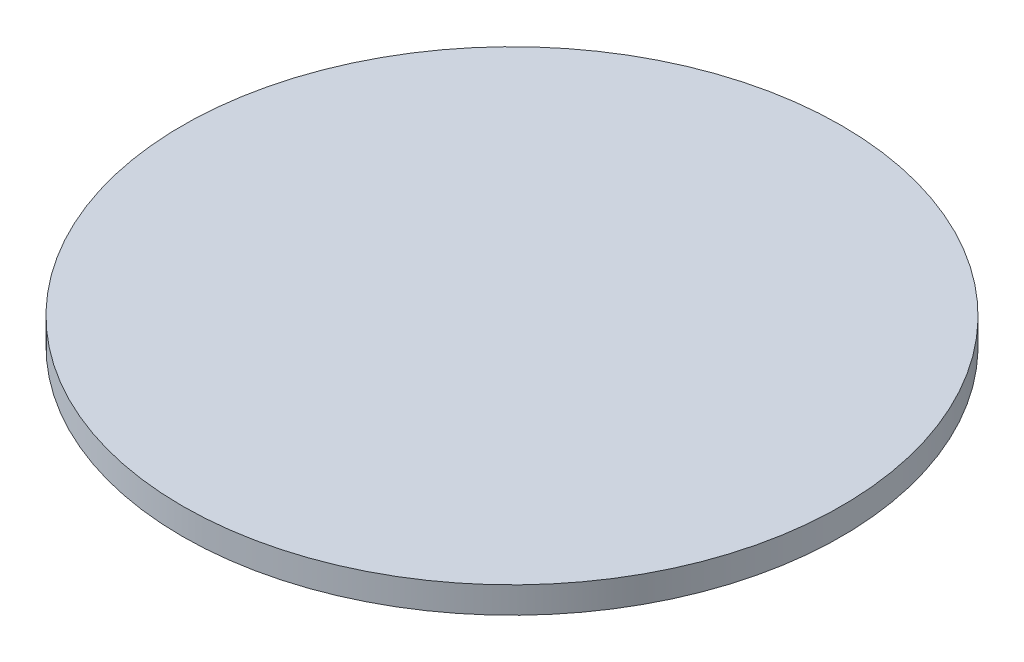
ISO-10303-21;
HEADER;
FILE_DESCRIPTION(('STEP AP214'),'2;1');
FILE_NAME('part.step','',(''),(''),'','','');
FILE_SCHEMA(('AUTOMOTIVE_DESIGN { 1 0 10303 214 1 1 1 1 }'));
ENDSEC;
DATA;
#1=APPLICATION_CONTEXT('core data for automotive mechanical design processes');
#2=APPLICATION_PROTOCOL_DEFINITION('international standard','automotive_design',2000,#1);
#3=PRODUCT_CONTEXT('',#1,'mechanical');
#4=PRODUCT('Part','Part','',(#3));
#5=PRODUCT_RELATED_PRODUCT_CATEGORY('part','',(#4));
#6=PRODUCT_DEFINITION_FORMATION('','',#4);
#7=PRODUCT_DEFINITION_CONTEXT('part definition',#1,'design');
#8=PRODUCT_DEFINITION('design','',#6,#7);
#9=PRODUCT_DEFINITION_SHAPE('','',#8);
#10=(LENGTH_UNIT() NAMED_UNIT(*) SI_UNIT(.MILLI.,.METRE.));
#11=(NAMED_UNIT(*) PLANE_ANGLE_UNIT() SI_UNIT($,.RADIAN.));
#12=(NAMED_UNIT(*) SI_UNIT($,.STERADIAN.) SOLID_ANGLE_UNIT());
#13=UNCERTAINTY_MEASURE_WITH_UNIT(LENGTH_MEASURE(1.E-05),#10,'distance_accuracy_value','');
#14=(GEOMETRIC_REPRESENTATION_CONTEXT(3) GLOBAL_UNCERTAINTY_ASSIGNED_CONTEXT((#13)) GLOBAL_UNIT_ASSIGNED_CONTEXT((#10,
#11,#12)) REPRESENTATION_CONTEXT('',''));
#15=CARTESIAN_POINT('',(0.,0.,0.));
#16=DIRECTION('',(0.,0.,1.));
#17=DIRECTION('',(1.,0.,0.));
#18=AXIS2_PLACEMENT_3D('',#15,#16,#17);
#19=CARTESIAN_POINT('',(0.,2.,0.));
#20=DIRECTION('',(0.,-1.,0.));
#21=DIRECTION('',(0.,0.,-1.));
#22=AXIS2_PLACEMENT_3D('',#19,#20,#21);
#23=CYLINDRICAL_SURFACE('',#22,25.);
#24=CARTESIAN_POINT('',(0.,2.,0.));
#25=DIRECTION('',(0.,1.,0.));
#26=DIRECTION('',(0.,0.,1.));
#27=AXIS2_PLACEMENT_3D('',#24,#25,#26);
#28=CIRCLE('',#27,25.);
#29=CARTESIAN_POINT('',(0.,2.,25.));
#30=VERTEX_POINT('',#29);
#31=EDGE_CURVE('E10',#30,#30,#28,.T.);
#32=ORIENTED_EDGE('',*,*,#31,.F.);
#33=EDGE_LOOP('',(#32));
#34=FACE_BOUND('',#33,.T.);
#35=CARTESIAN_POINT('',(0.,0.,0.));
#36=DIRECTION('',(0.,1.,0.));
#37=DIRECTION('',(0.,0.,1.));
#38=AXIS2_PLACEMENT_3D('',#35,#36,#37);
#39=CIRCLE('',#38,25.);
#40=CARTESIAN_POINT('',(0.,0.,25.));
#41=VERTEX_POINT('',#40);
#42=EDGE_CURVE('E40',#41,#41,#39,.T.);
#43=ORIENTED_EDGE('',*,*,#42,.T.);
#44=EDGE_LOOP('',(#43));
#45=FACE_BOUND('',#44,.T.);
#46=ADVANCED_FACE('F37',(#34,#45),#23,.T.);
#47=CARTESIAN_POINT('',(0.,2.,0.));
#48=DIRECTION('',(0.,1.,0.));
#49=DIRECTION('',(0.,0.,1.));
#50=AXIS2_PLACEMENT_3D('',#47,#48,#49);
#51=PLANE('',#50);
#52=ORIENTED_EDGE('',*,*,#31,.T.);
#53=EDGE_LOOP('',(#52));
#54=FACE_BOUND('',#53,.T.);
#55=ADVANCED_FACE('F54',(#54),#51,.T.);
#56=CARTESIAN_POINT('',(0.,0.,0.));
#57=DIRECTION('',(0.,1.,0.));
#58=DIRECTION('',(0.,0.,1.));
#59=AXIS2_PLACEMENT_3D('',#56,#57,#58);
#60=PLANE('',#59);
#61=ORIENTED_EDGE('',*,*,#42,.F.);
#62=EDGE_LOOP('',(#61));
#63=FACE_BOUND('',#62,.T.);
#64=ADVANCED_FACE('F52',(#63),#60,.F.);
#65=CLOSED_SHELL('',(#46,#55,#64));
#66=MANIFOLD_SOLID_BREP('B2',#65);
#67=ADVANCED_BREP_SHAPE_REPRESENTATION('',(#18,#66),#14);
#68=SHAPE_DEFINITION_REPRESENTATION(#9,#67);
ENDSEC;
END-ISO-10303-21;
